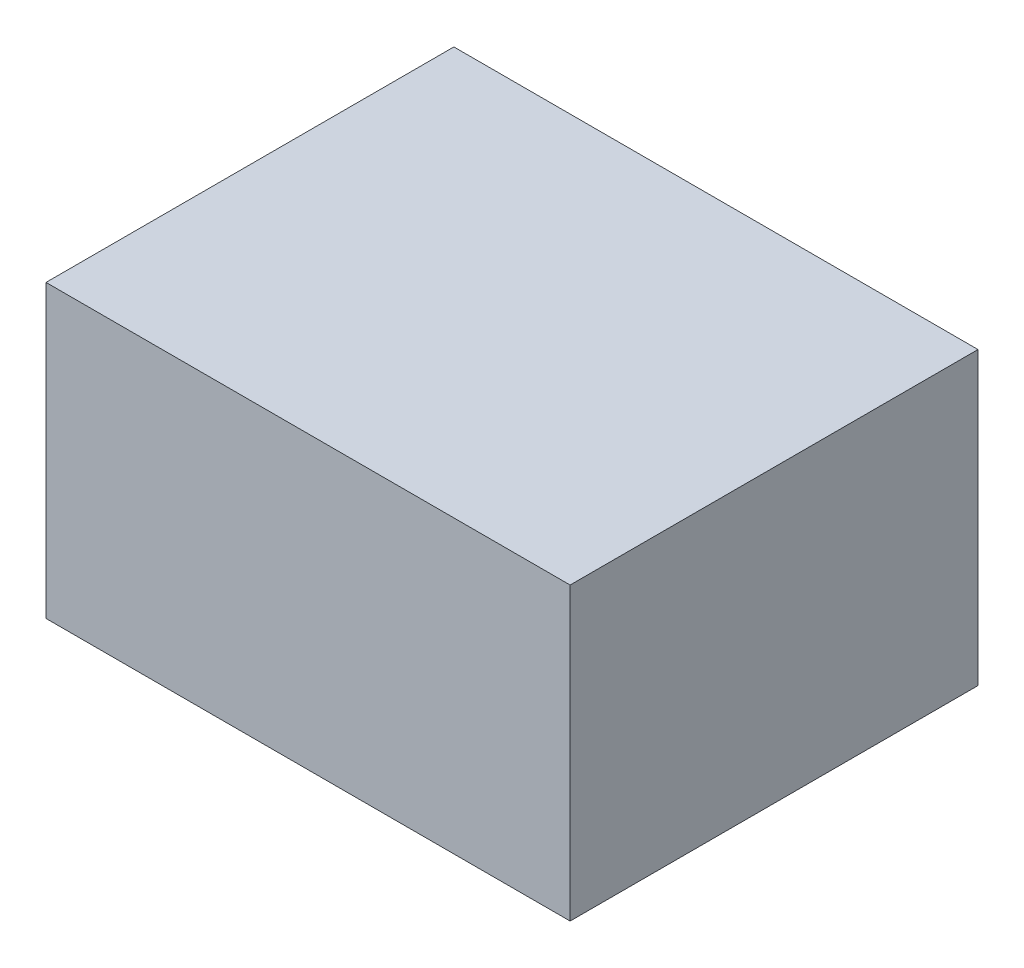
ISO-10303-21;
HEADER;
FILE_DESCRIPTION(('STEP AP214'),'2;1');
FILE_NAME('part.step','',(''),(''),'','','');
FILE_SCHEMA(('AUTOMOTIVE_DESIGN { 1 0 10303 214 1 1 1 1 }'));
ENDSEC;
DATA;
#1=APPLICATION_CONTEXT('core data for automotive mechanical design processes');
#2=APPLICATION_PROTOCOL_DEFINITION('international standard','automotive_design',2000,#1);
#3=PRODUCT_CONTEXT('',#1,'mechanical');
#4=PRODUCT('Part','Part','',(#3));
#5=PRODUCT_RELATED_PRODUCT_CATEGORY('part','',(#4));
#6=PRODUCT_DEFINITION_FORMATION('','',#4);
#7=PRODUCT_DEFINITION_CONTEXT('part definition',#1,'design');
#8=PRODUCT_DEFINITION('design','',#6,#7);
#9=PRODUCT_DEFINITION_SHAPE('','',#8);
#10=(LENGTH_UNIT() NAMED_UNIT(*) SI_UNIT(.MILLI.,.METRE.));
#11=(NAMED_UNIT(*) PLANE_ANGLE_UNIT() SI_UNIT($,.RADIAN.));
#12=(NAMED_UNIT(*) SI_UNIT($,.STERADIAN.) SOLID_ANGLE_UNIT());
#13=UNCERTAINTY_MEASURE_WITH_UNIT(LENGTH_MEASURE(1.E-05),#10,'distance_accuracy_value','');
#14=(GEOMETRIC_REPRESENTATION_CONTEXT(3) GLOBAL_UNCERTAINTY_ASSIGNED_CONTEXT((#13)) GLOBAL_UNIT_ASSIGNED_CONTEXT((#10,
#11,#12)) REPRESENTATION_CONTEXT('',''));
#15=CARTESIAN_POINT('',(0.,0.,0.));
#16=DIRECTION('',(0.,0.,1.));
#17=DIRECTION('',(1.,0.,0.));
#18=AXIS2_PLACEMENT_3D('',#15,#16,#17);
#19=CARTESIAN_POINT('',(-0.89949274,-0.499491,1.39999974));
#20=DIRECTION('',(0.,0.,1.));
#21=DIRECTION('',(1.,0.,0.));
#22=AXIS2_PLACEMENT_3D('',#19,#20,#21);
#23=PLANE('',#22);
#24=DIRECTION('',(-1.,0.,0.));
#25=VECTOR('',#24,1.);
#26=CARTESIAN_POINT('',(0.89949274,-0.499491,1.39999974));
#27=LINE('',#26,#25);
#28=CARTESIAN_POINT('',(0.89949274,-0.499491,1.39999974));
#29=VERTEX_POINT('',#28);
#30=CARTESIAN_POINT('',(-0.89949274,-0.499491,1.39999974));
#31=VERTEX_POINT('',#30);
#32=EDGE_CURVE('E20',#29,#31,#27,.T.);
#33=ORIENTED_EDGE('',*,*,#32,.F.);
#34=DIRECTION('',(0.,-1.,0.));
#35=VECTOR('',#34,1.);
#36=CARTESIAN_POINT('',(0.89949274,0.499491,1.39999974));
#37=LINE('',#36,#35);
#38=CARTESIAN_POINT('',(0.89949274,0.499491,1.39999974));
#39=VERTEX_POINT('',#38);
#40=EDGE_CURVE('E101',#39,#29,#37,.T.);
#41=ORIENTED_EDGE('',*,*,#40,.F.);
#42=DIRECTION('',(1.,0.,0.));
#43=VECTOR('',#42,1.);
#44=CARTESIAN_POINT('',(-0.89949274,0.499491,1.39999974));
#45=LINE('',#44,#43);
#46=CARTESIAN_POINT('',(-0.89949274,0.499491,1.39999974));
#47=VERTEX_POINT('',#46);
#48=EDGE_CURVE('E84',#47,#39,#45,.T.);
#49=ORIENTED_EDGE('',*,*,#48,.F.);
#50=DIRECTION('',(0.,1.,0.));
#51=VECTOR('',#50,1.);
#52=CARTESIAN_POINT('',(-0.89949274,-0.499491,1.39999974));
#53=LINE('',#52,#51);
#54=EDGE_CURVE('E88',#31,#47,#53,.T.);
#55=ORIENTED_EDGE('',*,*,#54,.F.);
#56=EDGE_LOOP('',(#33,#41,#49,#55));
#57=FACE_BOUND('',#56,.T.);
#58=ADVANCED_FACE('F17',(#57),#23,.T.);
#59=CARTESIAN_POINT('',(-0.89949274,-0.499491,0.));
#60=DIRECTION('',(0.,0.,1.));
#61=DIRECTION('',(1.,0.,0.));
#62=AXIS2_PLACEMENT_3D('',#59,#60,#61);
#63=PLANE('',#62);
#64=DIRECTION('',(0.,1.,0.));
#65=VECTOR('',#64,1.);
#66=CARTESIAN_POINT('',(-0.89949274,-0.499491,0.));
#67=LINE('',#66,#65);
#68=CARTESIAN_POINT('',(-0.89949274,-0.499491,0.));
#69=VERTEX_POINT('',#68);
#70=CARTESIAN_POINT('',(-0.89949274,0.499491,0.));
#71=VERTEX_POINT('',#70);
#72=EDGE_CURVE('E72',#69,#71,#67,.T.);
#73=ORIENTED_EDGE('',*,*,#72,.T.);
#74=DIRECTION('',(1.,0.,0.));
#75=VECTOR('',#74,1.);
#76=CARTESIAN_POINT('',(-0.89949274,0.499491,0.));
#77=LINE('',#76,#75);
#78=CARTESIAN_POINT('',(0.89949274,0.499491,0.));
#79=VERTEX_POINT('',#78);
#80=EDGE_CURVE('E98',#71,#79,#77,.T.);
#81=ORIENTED_EDGE('',*,*,#80,.T.);
#82=DIRECTION('',(0.,-1.,0.));
#83=VECTOR('',#82,1.);
#84=CARTESIAN_POINT('',(0.89949274,0.499491,0.));
#85=LINE('',#84,#83);
#86=CARTESIAN_POINT('',(0.89949274,-0.499491,0.));
#87=VERTEX_POINT('',#86);
#88=EDGE_CURVE('E74',#79,#87,#85,.T.);
#89=ORIENTED_EDGE('',*,*,#88,.T.);
#90=DIRECTION('',(-1.,0.,0.));
#91=VECTOR('',#90,1.);
#92=CARTESIAN_POINT('',(0.89949274,-0.499491,0.));
#93=LINE('',#92,#91);
#94=EDGE_CURVE('E11',#87,#69,#93,.T.);
#95=ORIENTED_EDGE('',*,*,#94,.T.);
#96=EDGE_LOOP('',(#73,#81,#89,#95));
#97=FACE_BOUND('',#96,.T.);
#98=ADVANCED_FACE('F70',(#97),#63,.F.);
#99=CARTESIAN_POINT('',(0.89949274,-0.499491,0.));
#100=DIRECTION('',(0.,-1.,0.));
#101=DIRECTION('',(0.,0.,-1.));
#102=AXIS2_PLACEMENT_3D('',#99,#100,#101);
#103=PLANE('',#102);
#104=DIRECTION('',(0.,0.,1.));
#105=VECTOR('',#104,1.);
#106=CARTESIAN_POINT('',(0.89949274,-0.499491,0.));
#107=LINE('',#106,#105);
#108=EDGE_CURVE('E112',#87,#29,#107,.T.);
#109=ORIENTED_EDGE('',*,*,#108,.T.);
#110=ORIENTED_EDGE('',*,*,#32,.T.);
#111=DIRECTION('',(0.,0.,1.));
#112=VECTOR('',#111,1.);
#113=CARTESIAN_POINT('',(-0.89949274,-0.499491,0.));
#114=LINE('',#113,#112);
#115=EDGE_CURVE('E80',#69,#31,#114,.T.);
#116=ORIENTED_EDGE('',*,*,#115,.F.);
#117=ORIENTED_EDGE('',*,*,#94,.F.);
#118=EDGE_LOOP('',(#109,#110,#116,#117));
#119=FACE_BOUND('',#118,.T.);
#120=ADVANCED_FACE('F86',(#119),#103,.T.);
#121=CARTESIAN_POINT('',(0.89949274,0.499491,0.));
#122=DIRECTION('',(1.,0.,0.));
#123=DIRECTION('',(0.,1.,0.));
#124=AXIS2_PLACEMENT_3D('',#121,#122,#123);
#125=PLANE('',#124);
#126=DIRECTION('',(0.,0.,1.));
#127=VECTOR('',#126,1.);
#128=CARTESIAN_POINT('',(0.89949274,0.499491,0.));
#129=LINE('',#128,#127);
#130=EDGE_CURVE('E102',#79,#39,#129,.T.);
#131=ORIENTED_EDGE('',*,*,#130,.T.);
#132=ORIENTED_EDGE('',*,*,#40,.T.);
#133=ORIENTED_EDGE('',*,*,#108,.F.);
#134=ORIENTED_EDGE('',*,*,#88,.F.);
#135=EDGE_LOOP('',(#131,#132,#133,#134));
#136=FACE_BOUND('',#135,.T.);
#137=ADVANCED_FACE('F144',(#136),#125,.T.);
#138=CARTESIAN_POINT('',(-0.89949274,0.499491,0.));
#139=DIRECTION('',(0.,1.,0.));
#140=DIRECTION('',(1.,0.,0.));
#141=AXIS2_PLACEMENT_3D('',#138,#139,#140);
#142=PLANE('',#141);
#143=DIRECTION('',(0.,0.,1.));
#144=VECTOR('',#143,1.);
#145=CARTESIAN_POINT('',(-0.89949274,0.499491,0.));
#146=LINE('',#145,#144);
#147=EDGE_CURVE('E82',#71,#47,#146,.T.);
#148=ORIENTED_EDGE('',*,*,#147,.T.);
#149=ORIENTED_EDGE('',*,*,#48,.T.);
#150=ORIENTED_EDGE('',*,*,#130,.F.);
#151=ORIENTED_EDGE('',*,*,#80,.F.);
#152=EDGE_LOOP('',(#148,#149,#150,#151));
#153=FACE_BOUND('',#152,.T.);
#154=ADVANCED_FACE('F133',(#153),#142,.T.);
#155=CARTESIAN_POINT('',(-0.89949274,-0.499491,0.));
#156=DIRECTION('',(-1.,0.,0.));
#157=DIRECTION('',(0.,0.,1.));
#158=AXIS2_PLACEMENT_3D('',#155,#156,#157);
#159=PLANE('',#158);
#160=ORIENTED_EDGE('',*,*,#115,.T.);
#161=ORIENTED_EDGE('',*,*,#54,.T.);
#162=ORIENTED_EDGE('',*,*,#147,.F.);
#163=ORIENTED_EDGE('',*,*,#72,.F.);
#164=EDGE_LOOP('',(#160,#161,#162,#163));
#165=FACE_BOUND('',#164,.T.);
#166=ADVANCED_FACE('F78',(#165),#159,.T.);
#167=CLOSED_SHELL('',(#58,#98,#120,#137,#154,#166));
#168=MANIFOLD_SOLID_BREP('B1',#167);
#169=ADVANCED_BREP_SHAPE_REPRESENTATION('',(#18,#168),#14);
#170=SHAPE_DEFINITION_REPRESENTATION(#9,#169);
ENDSEC;
END-ISO-10303-21;
